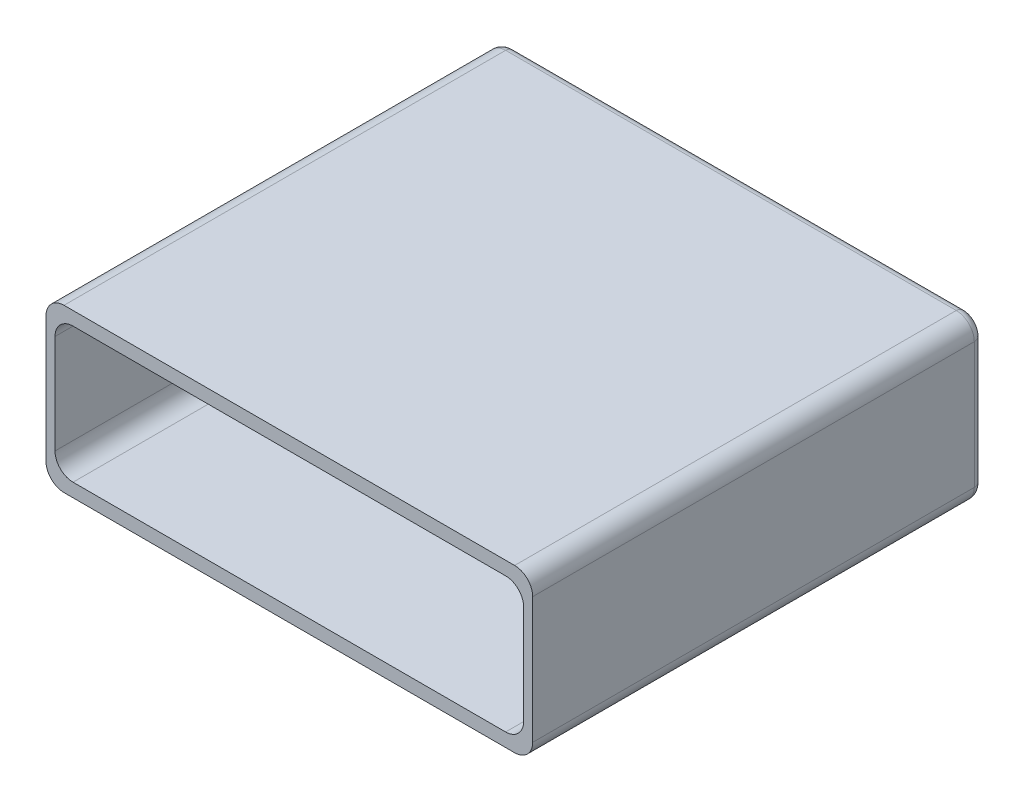
ISO-10303-21;
HEADER;
FILE_DESCRIPTION(('STEP AP214'),'2;1');
FILE_NAME('part.step','',(''),(''),'','','');
FILE_SCHEMA(('AUTOMOTIVE_DESIGN { 1 0 10303 214 1 1 1 1 }'));
ENDSEC;
DATA;
#1=APPLICATION_CONTEXT('core data for automotive mechanical design processes');
#2=APPLICATION_PROTOCOL_DEFINITION('international standard','automotive_design',2000,#1);
#3=PRODUCT_CONTEXT('',#1,'mechanical');
#4=PRODUCT('Part','Part','',(#3));
#5=PRODUCT_RELATED_PRODUCT_CATEGORY('part','',(#4));
#6=PRODUCT_DEFINITION_FORMATION('','',#4);
#7=PRODUCT_DEFINITION_CONTEXT('part definition',#1,'design');
#8=PRODUCT_DEFINITION('design','',#6,#7);
#9=PRODUCT_DEFINITION_SHAPE('','',#8);
#10=(LENGTH_UNIT() NAMED_UNIT(*) SI_UNIT(.MILLI.,.METRE.));
#11=(NAMED_UNIT(*) PLANE_ANGLE_UNIT() SI_UNIT($,.RADIAN.));
#12=(NAMED_UNIT(*) SI_UNIT($,.STERADIAN.) SOLID_ANGLE_UNIT());
#13=UNCERTAINTY_MEASURE_WITH_UNIT(LENGTH_MEASURE(1.E-05),#10,'distance_accuracy_value','');
#14=(GEOMETRIC_REPRESENTATION_CONTEXT(3) GLOBAL_UNCERTAINTY_ASSIGNED_CONTEXT((#13)) GLOBAL_UNIT_ASSIGNED_CONTEXT((#10,
#11,#12)) REPRESENTATION_CONTEXT('',''));
#15=CARTESIAN_POINT('',(0.,0.,0.));
#16=DIRECTION('',(0.,0.,1.));
#17=DIRECTION('',(1.,0.,0.));
#18=AXIS2_PLACEMENT_3D('',#15,#16,#17);
#19=CARTESIAN_POINT('',(-25.,-7.,50.));
#20=DIRECTION('',(0.,0.,-1.));
#21=DIRECTION('',(-1.,0.,0.));
#22=AXIS2_PLACEMENT_3D('',#19,#20,#21);
#23=CYLINDRICAL_SURFACE('',#22,2.);
#24=DIRECTION('',(0.,0.,-1.));
#25=VECTOR('',#24,1.);
#26=CARTESIAN_POINT('',(-27.,-6.99999999999999,50.));
#27=LINE('',#26,#25);
#28=CARTESIAN_POINT('',(-27.,-6.99999999999999,50.));
#29=VERTEX_POINT('',#28);
#30=CARTESIAN_POINT('',(-27.,-6.99999999999999,1.));
#31=VERTEX_POINT('',#30);
#32=EDGE_CURVE('E263',#29,#31,#27,.T.);
#33=ORIENTED_EDGE('',*,*,#32,.T.);
#34=CARTESIAN_POINT('',(-25.,-7.,1.));
#35=DIRECTION('',(0.,0.,1.));
#36=DIRECTION('',(1.,0.,0.));
#37=AXIS2_PLACEMENT_3D('',#34,#35,#36);
#38=CIRCLE('',#37,2.);
#39=CARTESIAN_POINT('',(-25.,-9.,1.));
#40=VERTEX_POINT('',#39);
#41=EDGE_CURVE('E284',#31,#40,#38,.T.);
#42=ORIENTED_EDGE('',*,*,#41,.T.);
#43=DIRECTION('',(0.,0.,-1.));
#44=VECTOR('',#43,1.);
#45=CARTESIAN_POINT('',(-25.,-9.,50.));
#46=LINE('',#45,#44);
#47=CARTESIAN_POINT('',(-25.,-9.,50.));
#48=VERTEX_POINT('',#47);
#49=EDGE_CURVE('E282',#48,#40,#46,.T.);
#50=ORIENTED_EDGE('',*,*,#49,.F.);
#51=CARTESIAN_POINT('',(-25.,-7.,50.));
#52=DIRECTION('',(0.,0.,1.));
#53=DIRECTION('',(1.,0.,0.));
#54=AXIS2_PLACEMENT_3D('',#51,#52,#53);
#55=CIRCLE('',#54,2.);
#56=EDGE_CURVE('E235',#29,#48,#55,.T.);
#57=ORIENTED_EDGE('',*,*,#56,.F.);
#58=EDGE_LOOP('',(#33,#42,#50,#57));
#59=FACE_BOUND('',#58,.T.);
#60=ADVANCED_FACE('F33',(#59),#23,.T.);
#61=CARTESIAN_POINT('',(25.,-9.,50.));
#62=DIRECTION('',(0.,1.,0.));
#63=DIRECTION('',(0.,0.,1.));
#64=AXIS2_PLACEMENT_3D('',#61,#62,#63);
#65=PLANE('',#64);
#66=ORIENTED_EDGE('',*,*,#49,.T.);
#67=DIRECTION('',(1.,0.,0.));
#68=VECTOR('',#67,1.);
#69=CARTESIAN_POINT('',(25.,-9.,1.));
#70=LINE('',#69,#68);
#71=CARTESIAN_POINT('',(25.,-9.,1.));
#72=VERTEX_POINT('',#71);
#73=EDGE_CURVE('E11',#40,#72,#70,.T.);
#74=ORIENTED_EDGE('',*,*,#73,.T.);
#75=DIRECTION('',(0.,0.,-1.));
#76=VECTOR('',#75,1.);
#77=CARTESIAN_POINT('',(25.,-9.,50.));
#78=LINE('',#77,#76);
#79=CARTESIAN_POINT('',(25.,-9.,50.));
#80=VERTEX_POINT('',#79);
#81=EDGE_CURVE('E280',#80,#72,#78,.T.);
#82=ORIENTED_EDGE('',*,*,#81,.F.);
#83=DIRECTION('',(1.,0.,0.));
#84=VECTOR('',#83,1.);
#85=CARTESIAN_POINT('',(25.,-9.,50.));
#86=LINE('',#85,#84);
#87=EDGE_CURVE('E249',#48,#80,#86,.T.);
#88=ORIENTED_EDGE('',*,*,#87,.F.);
#89=EDGE_LOOP('',(#66,#74,#82,#88));
#90=FACE_BOUND('',#89,.T.);
#91=ADVANCED_FACE('F406',(#90),#65,.F.);
#92=CARTESIAN_POINT('',(25.,-7.,50.));
#93=DIRECTION('',(0.,0.,-1.));
#94=DIRECTION('',(-1.,0.,0.));
#95=AXIS2_PLACEMENT_3D('',#92,#93,#94);
#96=CYLINDRICAL_SURFACE('',#95,2.);
#97=ORIENTED_EDGE('',*,*,#81,.T.);
#98=CARTESIAN_POINT('',(25.,-7.,1.));
#99=DIRECTION('',(0.,0.,1.));
#100=DIRECTION('',(1.,0.,0.));
#101=AXIS2_PLACEMENT_3D('',#98,#99,#100);
#102=CIRCLE('',#101,2.);
#103=CARTESIAN_POINT('',(27.,-6.99999999999999,1.));
#104=VERTEX_POINT('',#103);
#105=EDGE_CURVE('E42',#72,#104,#102,.T.);
#106=ORIENTED_EDGE('',*,*,#105,.T.);
#107=DIRECTION('',(0.,0.,-1.));
#108=VECTOR('',#107,1.);
#109=CARTESIAN_POINT('',(27.,-6.99999999999999,50.));
#110=LINE('',#109,#108);
#111=CARTESIAN_POINT('',(27.,-6.99999999999999,50.));
#112=VERTEX_POINT('',#111);
#113=EDGE_CURVE('E278',#112,#104,#110,.T.);
#114=ORIENTED_EDGE('',*,*,#113,.F.);
#115=CARTESIAN_POINT('',(25.,-7.,50.));
#116=DIRECTION('',(0.,0.,1.));
#117=DIRECTION('',(-1.,0.,0.));
#118=AXIS2_PLACEMENT_3D('',#115,#116,#117);
#119=CIRCLE('',#118,2.);
#120=EDGE_CURVE('E251',#80,#112,#119,.T.);
#121=ORIENTED_EDGE('',*,*,#120,.F.);
#122=EDGE_LOOP('',(#97,#106,#114,#121));
#123=FACE_BOUND('',#122,.T.);
#124=ADVANCED_FACE('F411',(#123),#96,.T.);
#125=CARTESIAN_POINT('',(27.,6.99999999999999,50.));
#126=DIRECTION('',(-1.,0.,0.));
#127=DIRECTION('',(0.,0.,1.));
#128=AXIS2_PLACEMENT_3D('',#125,#126,#127);
#129=PLANE('',#128);
#130=ORIENTED_EDGE('',*,*,#113,.T.);
#131=DIRECTION('',(0.,1.,0.));
#132=VECTOR('',#131,1.);
#133=CARTESIAN_POINT('',(27.,6.99999999999999,1.));
#134=LINE('',#133,#132);
#135=CARTESIAN_POINT('',(27.,6.99999999999999,1.));
#136=VERTEX_POINT('',#135);
#137=EDGE_CURVE('E312',#104,#136,#134,.T.);
#138=ORIENTED_EDGE('',*,*,#137,.T.);
#139=DIRECTION('',(0.,0.,-1.));
#140=VECTOR('',#139,1.);
#141=CARTESIAN_POINT('',(27.,6.99999999999999,50.));
#142=LINE('',#141,#140);
#143=CARTESIAN_POINT('',(27.,6.99999999999999,50.));
#144=VERTEX_POINT('',#143);
#145=EDGE_CURVE('E275',#144,#136,#142,.T.);
#146=ORIENTED_EDGE('',*,*,#145,.F.);
#147=DIRECTION('',(0.,1.,0.));
#148=VECTOR('',#147,1.);
#149=CARTESIAN_POINT('',(27.,6.99999999999999,50.));
#150=LINE('',#149,#148);
#151=EDGE_CURVE('E253',#112,#144,#150,.T.);
#152=ORIENTED_EDGE('',*,*,#151,.F.);
#153=EDGE_LOOP('',(#130,#138,#146,#152));
#154=FACE_BOUND('',#153,.T.);
#155=ADVANCED_FACE('F384',(#154),#129,.F.);
#156=CARTESIAN_POINT('',(25.,7.,50.));
#157=DIRECTION('',(0.,0.,-1.));
#158=DIRECTION('',(-1.,0.,0.));
#159=AXIS2_PLACEMENT_3D('',#156,#157,#158);
#160=CYLINDRICAL_SURFACE('',#159,2.);
#161=ORIENTED_EDGE('',*,*,#145,.T.);
#162=CARTESIAN_POINT('',(25.,7.,1.));
#163=DIRECTION('',(0.,0.,1.));
#164=DIRECTION('',(1.,0.,0.));
#165=AXIS2_PLACEMENT_3D('',#162,#163,#164);
#166=CIRCLE('',#165,2.);
#167=CARTESIAN_POINT('',(25.,9.,1.));
#168=VERTEX_POINT('',#167);
#169=EDGE_CURVE('E310',#136,#168,#166,.T.);
#170=ORIENTED_EDGE('',*,*,#169,.T.);
#171=DIRECTION('',(0.,0.,-1.));
#172=VECTOR('',#171,1.);
#173=CARTESIAN_POINT('',(25.,9.,50.));
#174=LINE('',#173,#172);
#175=CARTESIAN_POINT('',(25.,9.,50.));
#176=VERTEX_POINT('',#175);
#177=EDGE_CURVE('E272',#176,#168,#174,.T.);
#178=ORIENTED_EDGE('',*,*,#177,.F.);
#179=CARTESIAN_POINT('',(25.,7.,50.));
#180=DIRECTION('',(0.,0.,1.));
#181=DIRECTION('',(-1.,0.,0.));
#182=AXIS2_PLACEMENT_3D('',#179,#180,#181);
#183=CIRCLE('',#182,2.);
#184=EDGE_CURVE('E255',#144,#176,#183,.T.);
#185=ORIENTED_EDGE('',*,*,#184,.F.);
#186=EDGE_LOOP('',(#161,#170,#178,#185));
#187=FACE_BOUND('',#186,.T.);
#188=ADVANCED_FACE('F380',(#187),#160,.T.);
#189=CARTESIAN_POINT('',(25.,9.,50.));
#190=DIRECTION('',(0.,-1.,0.));
#191=DIRECTION('',(0.,0.,-1.));
#192=AXIS2_PLACEMENT_3D('',#189,#190,#191);
#193=PLANE('',#192);
#194=ORIENTED_EDGE('',*,*,#177,.T.);
#195=DIRECTION('',(-1.,0.,0.));
#196=VECTOR('',#195,1.);
#197=CARTESIAN_POINT('',(25.,9.,1.));
#198=LINE('',#197,#196);
#199=CARTESIAN_POINT('',(-25.,9.,1.));
#200=VERTEX_POINT('',#199);
#201=EDGE_CURVE('E308',#168,#200,#198,.T.);
#202=ORIENTED_EDGE('',*,*,#201,.T.);
#203=DIRECTION('',(0.,0.,-1.));
#204=VECTOR('',#203,1.);
#205=CARTESIAN_POINT('',(-25.,9.,50.));
#206=LINE('',#205,#204);
#207=CARTESIAN_POINT('',(-25.,9.,50.));
#208=VERTEX_POINT('',#207);
#209=EDGE_CURVE('E269',#208,#200,#206,.T.);
#210=ORIENTED_EDGE('',*,*,#209,.F.);
#211=DIRECTION('',(-1.,0.,0.));
#212=VECTOR('',#211,1.);
#213=CARTESIAN_POINT('',(25.,9.,50.));
#214=LINE('',#213,#212);
#215=EDGE_CURVE('E257',#176,#208,#214,.T.);
#216=ORIENTED_EDGE('',*,*,#215,.F.);
#217=EDGE_LOOP('',(#194,#202,#210,#216));
#218=FACE_BOUND('',#217,.T.);
#219=ADVANCED_FACE('F376',(#218),#193,.F.);
#220=CARTESIAN_POINT('',(-25.,7.,50.));
#221=DIRECTION('',(0.,0.,-1.));
#222=DIRECTION('',(-1.,0.,0.));
#223=AXIS2_PLACEMENT_3D('',#220,#221,#222);
#224=CYLINDRICAL_SURFACE('',#223,2.);
#225=ORIENTED_EDGE('',*,*,#209,.T.);
#226=CARTESIAN_POINT('',(-25.,7.,1.));
#227=DIRECTION('',(0.,0.,1.));
#228=DIRECTION('',(1.,0.,0.));
#229=AXIS2_PLACEMENT_3D('',#226,#227,#228);
#230=CIRCLE('',#229,2.);
#231=CARTESIAN_POINT('',(-27.,6.99999999999999,1.));
#232=VERTEX_POINT('',#231);
#233=EDGE_CURVE('E306',#200,#232,#230,.T.);
#234=ORIENTED_EDGE('',*,*,#233,.T.);
#235=DIRECTION('',(0.,0.,-1.));
#236=VECTOR('',#235,1.);
#237=CARTESIAN_POINT('',(-27.,6.99999999999999,50.));
#238=LINE('',#237,#236);
#239=CARTESIAN_POINT('',(-27.,6.99999999999999,50.));
#240=VERTEX_POINT('',#239);
#241=EDGE_CURVE('E266',#240,#232,#238,.T.);
#242=ORIENTED_EDGE('',*,*,#241,.F.);
#243=CARTESIAN_POINT('',(-25.,7.,50.));
#244=DIRECTION('',(0.,0.,1.));
#245=DIRECTION('',(1.,0.,0.));
#246=AXIS2_PLACEMENT_3D('',#243,#244,#245);
#247=CIRCLE('',#246,2.);
#248=EDGE_CURVE('E259',#208,#240,#247,.T.);
#249=ORIENTED_EDGE('',*,*,#248,.F.);
#250=EDGE_LOOP('',(#225,#234,#242,#249));
#251=FACE_BOUND('',#250,.T.);
#252=ADVANCED_FACE('F374',(#251),#224,.T.);
#253=CARTESIAN_POINT('',(-27.,6.99999999999999,50.));
#254=DIRECTION('',(1.,0.,0.));
#255=DIRECTION('',(0.,0.,-1.));
#256=AXIS2_PLACEMENT_3D('',#253,#254,#255);
#257=PLANE('',#256);
#258=ORIENTED_EDGE('',*,*,#241,.T.);
#259=DIRECTION('',(0.,-1.,0.));
#260=VECTOR('',#259,1.);
#261=CARTESIAN_POINT('',(-27.,6.99999999999999,1.));
#262=LINE('',#261,#260);
#263=EDGE_CURVE('E304',#232,#31,#262,.T.);
#264=ORIENTED_EDGE('',*,*,#263,.T.);
#265=ORIENTED_EDGE('',*,*,#32,.F.);
#266=DIRECTION('',(0.,-1.,0.));
#267=VECTOR('',#266,1.);
#268=CARTESIAN_POINT('',(-27.,6.99999999999999,50.));
#269=LINE('',#268,#267);
#270=EDGE_CURVE('E261',#240,#29,#269,.T.);
#271=ORIENTED_EDGE('',*,*,#270,.F.);
#272=EDGE_LOOP('',(#258,#264,#265,#271));
#273=FACE_BOUND('',#272,.T.);
#274=ADVANCED_FACE('F362',(#273),#257,.F.);
#275=CARTESIAN_POINT('',(-25.,-7.,50.));
#276=DIRECTION('',(0.,0.,1.));
#277=DIRECTION('',(1.,0.,0.));
#278=AXIS2_PLACEMENT_3D('',#275,#276,#277);
#279=PLANE('',#278);
#280=CARTESIAN_POINT('',(24.,-5.5,50.));
#281=DIRECTION('',(0.,0.,1.));
#282=DIRECTION('',(1.,0.,0.));
#283=AXIS2_PLACEMENT_3D('',#280,#281,#282);
#284=CIRCLE('',#283,2.);
#285=CARTESIAN_POINT('',(24.,-7.5,50.));
#286=VERTEX_POINT('',#285);
#287=CARTESIAN_POINT('',(26.,-5.5,50.));
#288=VERTEX_POINT('',#287);
#289=EDGE_CURVE('E179',#286,#288,#284,.T.);
#290=ORIENTED_EDGE('',*,*,#289,.F.);
#291=DIRECTION('',(1.,0.,0.));
#292=VECTOR('',#291,1.);
#293=CARTESIAN_POINT('',(24.,-7.5,50.));
#294=LINE('',#293,#292);
#295=CARTESIAN_POINT('',(-24.,-7.5,50.));
#296=VERTEX_POINT('',#295);
#297=EDGE_CURVE('E197',#296,#286,#294,.T.);
#298=ORIENTED_EDGE('',*,*,#297,.F.);
#299=CARTESIAN_POINT('',(-24.,-5.5,50.));
#300=DIRECTION('',(0.,0.,1.));
#301=DIRECTION('',(1.,0.,0.));
#302=AXIS2_PLACEMENT_3D('',#299,#300,#301);
#303=CIRCLE('',#302,2.);
#304=CARTESIAN_POINT('',(-26.,-5.5,50.));
#305=VERTEX_POINT('',#304);
#306=EDGE_CURVE('E200',#305,#296,#303,.T.);
#307=ORIENTED_EDGE('',*,*,#306,.F.);
#308=DIRECTION('',(0.,-1.,0.));
#309=VECTOR('',#308,1.);
#310=CARTESIAN_POINT('',(-26.,-5.5,50.));
#311=LINE('',#310,#309);
#312=CARTESIAN_POINT('',(-26.,5.5,50.));
#313=VERTEX_POINT('',#312);
#314=EDGE_CURVE('E228',#313,#305,#311,.T.);
#315=ORIENTED_EDGE('',*,*,#314,.F.);
#316=CARTESIAN_POINT('',(-24.,5.5,50.));
#317=DIRECTION('',(0.,0.,1.));
#318=DIRECTION('',(1.,0.,0.));
#319=AXIS2_PLACEMENT_3D('',#316,#317,#318);
#320=CIRCLE('',#319,2.);
#321=CARTESIAN_POINT('',(-24.,7.5,50.));
#322=VERTEX_POINT('',#321);
#323=EDGE_CURVE('E225',#322,#313,#320,.T.);
#324=ORIENTED_EDGE('',*,*,#323,.F.);
#325=DIRECTION('',(-1.,0.,0.));
#326=VECTOR('',#325,1.);
#327=CARTESIAN_POINT('',(24.,7.5,50.));
#328=LINE('',#327,#326);
#329=CARTESIAN_POINT('',(24.,7.5,50.));
#330=VERTEX_POINT('',#329);
#331=EDGE_CURVE('E222',#330,#322,#328,.T.);
#332=ORIENTED_EDGE('',*,*,#331,.F.);
#333=CARTESIAN_POINT('',(24.,5.5,50.));
#334=DIRECTION('',(0.,0.,1.));
#335=DIRECTION('',(1.,0.,0.));
#336=AXIS2_PLACEMENT_3D('',#333,#334,#335);
#337=CIRCLE('',#336,2.);
#338=CARTESIAN_POINT('',(26.,5.5,50.));
#339=VERTEX_POINT('',#338);
#340=EDGE_CURVE('E219',#339,#330,#337,.T.);
#341=ORIENTED_EDGE('',*,*,#340,.F.);
#342=DIRECTION('',(0.,1.,0.));
#343=VECTOR('',#342,1.);
#344=CARTESIAN_POINT('',(26.,-5.5,50.));
#345=LINE('',#344,#343);
#346=EDGE_CURVE('E217',#288,#339,#345,.T.);
#347=ORIENTED_EDGE('',*,*,#346,.F.);
#348=EDGE_LOOP('',(#290,#298,#307,#315,#324,#332,#341,#347));
#349=FACE_BOUND('',#348,.T.);
#350=ORIENTED_EDGE('',*,*,#56,.T.);
#351=ORIENTED_EDGE('',*,*,#87,.T.);
#352=ORIENTED_EDGE('',*,*,#120,.T.);
#353=ORIENTED_EDGE('',*,*,#151,.T.);
#354=ORIENTED_EDGE('',*,*,#184,.T.);
#355=ORIENTED_EDGE('',*,*,#215,.T.);
#356=ORIENTED_EDGE('',*,*,#248,.T.);
#357=ORIENTED_EDGE('',*,*,#270,.T.);
#358=EDGE_LOOP('',(#350,#351,#352,#353,#354,#355,#356,#357));
#359=FACE_BOUND('',#358,.T.);
#360=ADVANCED_FACE('F369',(#349,#359),#279,.T.);
#361=CARTESIAN_POINT('',(-25.,-7.,0.));
#362=DIRECTION('',(0.,0.,1.));
#363=DIRECTION('',(1.,0.,0.));
#364=AXIS2_PLACEMENT_3D('',#361,#362,#363);
#365=PLANE('',#364);
#366=DIRECTION('',(1.,0.,0.));
#367=VECTOR('',#366,1.);
#368=CARTESIAN_POINT('',(-25.,-8.,0.));
#369=LINE('',#368,#367);
#370=CARTESIAN_POINT('',(25.,-8.,0.));
#371=VERTEX_POINT('',#370);
#372=CARTESIAN_POINT('',(-25.,-8.,0.));
#373=VERTEX_POINT('',#372);
#374=EDGE_CURVE('E287',#371,#373,#369,.F.);
#375=ORIENTED_EDGE('',*,*,#374,.T.);
#376=CARTESIAN_POINT('',(-25.,-7.,0.));
#377=DIRECTION('',(0.,0.,1.));
#378=DIRECTION('',(1.,0.,0.));
#379=AXIS2_PLACEMENT_3D('',#376,#377,#378);
#380=CIRCLE('',#379,1.);
#381=CARTESIAN_POINT('',(-26.,-6.99999999999999,0.));
#382=VERTEX_POINT('',#381);
#383=EDGE_CURVE('E301',#373,#382,#380,.F.);
#384=ORIENTED_EDGE('',*,*,#383,.T.);
#385=DIRECTION('',(0.,-1.,0.));
#386=VECTOR('',#385,1.);
#387=CARTESIAN_POINT('',(-26.,-7.,0.));
#388=LINE('',#387,#386);
#389=CARTESIAN_POINT('',(-26.,6.99999999999999,0.));
#390=VERTEX_POINT('',#389);
#391=EDGE_CURVE('E299',#382,#390,#388,.F.);
#392=ORIENTED_EDGE('',*,*,#391,.T.);
#393=CARTESIAN_POINT('',(-25.,7.,0.));
#394=DIRECTION('',(0.,0.,1.));
#395=DIRECTION('',(1.,0.,0.));
#396=AXIS2_PLACEMENT_3D('',#393,#394,#395);
#397=CIRCLE('',#396,1.);
#398=CARTESIAN_POINT('',(-25.,8.,0.));
#399=VERTEX_POINT('',#398);
#400=EDGE_CURVE('E297',#390,#399,#397,.F.);
#401=ORIENTED_EDGE('',*,*,#400,.T.);
#402=DIRECTION('',(-1.,0.,0.));
#403=VECTOR('',#402,1.);
#404=CARTESIAN_POINT('',(-25.,8.,0.));
#405=LINE('',#404,#403);
#406=CARTESIAN_POINT('',(25.,8.,0.));
#407=VERTEX_POINT('',#406);
#408=EDGE_CURVE('E295',#399,#407,#405,.F.);
#409=ORIENTED_EDGE('',*,*,#408,.T.);
#410=CARTESIAN_POINT('',(25.,7.,0.));
#411=DIRECTION('',(0.,0.,1.));
#412=DIRECTION('',(1.,0.,0.));
#413=AXIS2_PLACEMENT_3D('',#410,#411,#412);
#414=CIRCLE('',#413,1.);
#415=CARTESIAN_POINT('',(26.,6.99999999999999,0.));
#416=VERTEX_POINT('',#415);
#417=EDGE_CURVE('E293',#407,#416,#414,.F.);
#418=ORIENTED_EDGE('',*,*,#417,.T.);
#419=DIRECTION('',(0.,1.,0.));
#420=VECTOR('',#419,1.);
#421=CARTESIAN_POINT('',(26.,-7.,0.));
#422=LINE('',#421,#420);
#423=CARTESIAN_POINT('',(26.,-6.99999999999999,0.));
#424=VERTEX_POINT('',#423);
#425=EDGE_CURVE('E291',#416,#424,#422,.F.);
#426=ORIENTED_EDGE('',*,*,#425,.T.);
#427=CARTESIAN_POINT('',(25.,-7.,0.));
#428=DIRECTION('',(0.,0.,1.));
#429=DIRECTION('',(1.,0.,0.));
#430=AXIS2_PLACEMENT_3D('',#427,#428,#429);
#431=CIRCLE('',#430,1.);
#432=EDGE_CURVE('E289',#424,#371,#431,.F.);
#433=ORIENTED_EDGE('',*,*,#432,.T.);
#434=EDGE_LOOP('',(#375,#384,#392,#401,#409,#418,#426,#433));
#435=FACE_BOUND('',#434,.T.);
#436=ADVANCED_FACE('F347',(#435),#365,.F.);
#437=CARTESIAN_POINT('',(24.,-5.5,2.));
#438=DIRECTION('',(0.,0.,1.));
#439=DIRECTION('',(1.,0.,0.));
#440=AXIS2_PLACEMENT_3D('',#437,#438,#439);
#441=CYLINDRICAL_SURFACE('',#440,2.);
#442=ORIENTED_EDGE('',*,*,#289,.T.);
#443=DIRECTION('',(0.,0.,1.));
#444=VECTOR('',#443,1.);
#445=CARTESIAN_POINT('',(26.,-5.5,2.));
#446=LINE('',#445,#444);
#447=CARTESIAN_POINT('',(26.,-5.5,2.));
#448=VERTEX_POINT('',#447);
#449=EDGE_CURVE('E172',#448,#288,#446,.T.);
#450=ORIENTED_EDGE('',*,*,#449,.F.);
#451=CARTESIAN_POINT('',(24.,-5.5,2.));
#452=DIRECTION('',(0.,0.,1.));
#453=DIRECTION('',(1.,0.,0.));
#454=AXIS2_PLACEMENT_3D('',#451,#452,#453);
#455=CIRCLE('',#454,2.);
#456=CARTESIAN_POINT('',(24.,-7.5,2.));
#457=VERTEX_POINT('',#456);
#458=EDGE_CURVE('E176',#457,#448,#455,.T.);
#459=ORIENTED_EDGE('',*,*,#458,.F.);
#460=DIRECTION('',(0.,0.,1.));
#461=VECTOR('',#460,1.);
#462=CARTESIAN_POINT('',(24.,-7.5,2.));
#463=LINE('',#462,#461);
#464=EDGE_CURVE('E233',#457,#286,#463,.T.);
#465=ORIENTED_EDGE('',*,*,#464,.T.);
#466=EDGE_LOOP('',(#442,#450,#459,#465));
#467=FACE_BOUND('',#466,.T.);
#468=ADVANCED_FACE('F174',(#467),#441,.F.);
#469=CARTESIAN_POINT('',(24.,-7.5,2.));
#470=DIRECTION('',(0.,-1.,0.));
#471=DIRECTION('',(1.,0.,0.));
#472=AXIS2_PLACEMENT_3D('',#469,#470,#471);
#473=PLANE('',#472);
#474=ORIENTED_EDGE('',*,*,#297,.T.);
#475=ORIENTED_EDGE('',*,*,#464,.F.);
#476=DIRECTION('',(1.,0.,0.));
#477=VECTOR('',#476,1.);
#478=CARTESIAN_POINT('',(24.,-7.5,2.));
#479=LINE('',#478,#477);
#480=CARTESIAN_POINT('',(-24.,-7.5,2.));
#481=VERTEX_POINT('',#480);
#482=EDGE_CURVE('E184',#481,#457,#479,.T.);
#483=ORIENTED_EDGE('',*,*,#482,.F.);
#484=DIRECTION('',(0.,0.,1.));
#485=VECTOR('',#484,1.);
#486=CARTESIAN_POINT('',(-24.,-7.5,2.));
#487=LINE('',#486,#485);
#488=EDGE_CURVE('E236',#481,#296,#487,.T.);
#489=ORIENTED_EDGE('',*,*,#488,.T.);
#490=EDGE_LOOP('',(#474,#475,#483,#489));
#491=FACE_BOUND('',#490,.T.);
#492=ADVANCED_FACE('F433',(#491),#473,.F.);
#493=CARTESIAN_POINT('',(-24.,-5.5,2.));
#494=DIRECTION('',(0.,0.,1.));
#495=DIRECTION('',(1.,0.,0.));
#496=AXIS2_PLACEMENT_3D('',#493,#494,#495);
#497=CYLINDRICAL_SURFACE('',#496,2.);
#498=ORIENTED_EDGE('',*,*,#306,.T.);
#499=ORIENTED_EDGE('',*,*,#488,.F.);
#500=CARTESIAN_POINT('',(-24.,-5.5,2.));
#501=DIRECTION('',(0.,0.,1.));
#502=DIRECTION('',(1.,0.,0.));
#503=AXIS2_PLACEMENT_3D('',#500,#501,#502);
#504=CIRCLE('',#503,2.);
#505=CARTESIAN_POINT('',(-26.,-5.5,2.));
#506=VERTEX_POINT('',#505);
#507=EDGE_CURVE('E213',#506,#481,#504,.T.);
#508=ORIENTED_EDGE('',*,*,#507,.F.);
#509=DIRECTION('',(0.,0.,1.));
#510=VECTOR('',#509,1.);
#511=CARTESIAN_POINT('',(-26.,-5.5,2.));
#512=LINE('',#511,#510);
#513=EDGE_CURVE('E238',#506,#305,#512,.T.);
#514=ORIENTED_EDGE('',*,*,#513,.T.);
#515=EDGE_LOOP('',(#498,#499,#508,#514));
#516=FACE_BOUND('',#515,.T.);
#517=ADVANCED_FACE('F451',(#516),#497,.F.);
#518=CARTESIAN_POINT('',(-26.,-5.5,2.));
#519=DIRECTION('',(-1.,0.,0.));
#520=DIRECTION('',(0.,0.,1.));
#521=AXIS2_PLACEMENT_3D('',#518,#519,#520);
#522=PLANE('',#521);
#523=ORIENTED_EDGE('',*,*,#314,.T.);
#524=ORIENTED_EDGE('',*,*,#513,.F.);
#525=DIRECTION('',(0.,-1.,0.));
#526=VECTOR('',#525,1.);
#527=CARTESIAN_POINT('',(-26.,-5.5,2.));
#528=LINE('',#527,#526);
#529=CARTESIAN_POINT('',(-26.,5.5,2.));
#530=VERTEX_POINT('',#529);
#531=EDGE_CURVE('E210',#530,#506,#528,.T.);
#532=ORIENTED_EDGE('',*,*,#531,.F.);
#533=DIRECTION('',(0.,0.,1.));
#534=VECTOR('',#533,1.);
#535=CARTESIAN_POINT('',(-26.,5.5,2.));
#536=LINE('',#535,#534);
#537=EDGE_CURVE('E240',#530,#313,#536,.T.);
#538=ORIENTED_EDGE('',*,*,#537,.T.);
#539=EDGE_LOOP('',(#523,#524,#532,#538));
#540=FACE_BOUND('',#539,.T.);
#541=ADVANCED_FACE('F447',(#540),#522,.F.);
#542=CARTESIAN_POINT('',(-24.,5.5,2.));
#543=DIRECTION('',(0.,0.,1.));
#544=DIRECTION('',(1.,0.,0.));
#545=AXIS2_PLACEMENT_3D('',#542,#543,#544);
#546=CYLINDRICAL_SURFACE('',#545,2.);
#547=ORIENTED_EDGE('',*,*,#323,.T.);
#548=ORIENTED_EDGE('',*,*,#537,.F.);
#549=CARTESIAN_POINT('',(-24.,5.5,2.));
#550=DIRECTION('',(0.,0.,1.));
#551=DIRECTION('',(1.,0.,0.));
#552=AXIS2_PLACEMENT_3D('',#549,#550,#551);
#553=CIRCLE('',#552,2.);
#554=CARTESIAN_POINT('',(-24.,7.5,2.));
#555=VERTEX_POINT('',#554);
#556=EDGE_CURVE('E207',#555,#530,#553,.T.);
#557=ORIENTED_EDGE('',*,*,#556,.F.);
#558=DIRECTION('',(0.,0.,1.));
#559=VECTOR('',#558,1.);
#560=CARTESIAN_POINT('',(-24.,7.5,2.));
#561=LINE('',#560,#559);
#562=EDGE_CURVE('E242',#555,#322,#561,.T.);
#563=ORIENTED_EDGE('',*,*,#562,.T.);
#564=EDGE_LOOP('',(#547,#548,#557,#563));
#565=FACE_BOUND('',#564,.T.);
#566=ADVANCED_FACE('F443',(#565),#546,.F.);
#567=CARTESIAN_POINT('',(24.,7.5,2.));
#568=DIRECTION('',(0.,1.,0.));
#569=DIRECTION('',(-1.,0.,0.));
#570=AXIS2_PLACEMENT_3D('',#567,#568,#569);
#571=PLANE('',#570);
#572=ORIENTED_EDGE('',*,*,#331,.T.);
#573=ORIENTED_EDGE('',*,*,#562,.F.);
#574=DIRECTION('',(-1.,0.,0.));
#575=VECTOR('',#574,1.);
#576=CARTESIAN_POINT('',(24.,7.5,2.));
#577=LINE('',#576,#575);
#578=CARTESIAN_POINT('',(24.,7.5,2.));
#579=VERTEX_POINT('',#578);
#580=EDGE_CURVE('E204',#579,#555,#577,.T.);
#581=ORIENTED_EDGE('',*,*,#580,.F.);
#582=DIRECTION('',(0.,0.,1.));
#583=VECTOR('',#582,1.);
#584=CARTESIAN_POINT('',(24.,7.5,2.));
#585=LINE('',#584,#583);
#586=EDGE_CURVE('E244',#579,#330,#585,.T.);
#587=ORIENTED_EDGE('',*,*,#586,.T.);
#588=EDGE_LOOP('',(#572,#573,#581,#587));
#589=FACE_BOUND('',#588,.T.);
#590=ADVANCED_FACE('F439',(#589),#571,.F.);
#591=CARTESIAN_POINT('',(24.,5.5,2.));
#592=DIRECTION('',(0.,0.,1.));
#593=DIRECTION('',(1.,0.,0.));
#594=AXIS2_PLACEMENT_3D('',#591,#592,#593);
#595=CYLINDRICAL_SURFACE('',#594,2.);
#596=ORIENTED_EDGE('',*,*,#340,.T.);
#597=ORIENTED_EDGE('',*,*,#586,.F.);
#598=CARTESIAN_POINT('',(24.,5.5,2.));
#599=DIRECTION('',(0.,0.,1.));
#600=DIRECTION('',(1.,0.,0.));
#601=AXIS2_PLACEMENT_3D('',#598,#599,#600);
#602=CIRCLE('',#601,2.);
#603=CARTESIAN_POINT('',(26.,5.5,2.));
#604=VERTEX_POINT('',#603);
#605=EDGE_CURVE('E192',#604,#579,#602,.T.);
#606=ORIENTED_EDGE('',*,*,#605,.F.);
#607=DIRECTION('',(0.,0.,1.));
#608=VECTOR('',#607,1.);
#609=CARTESIAN_POINT('',(26.,5.5,2.));
#610=LINE('',#609,#608);
#611=EDGE_CURVE('E183',#604,#339,#610,.T.);
#612=ORIENTED_EDGE('',*,*,#611,.T.);
#613=EDGE_LOOP('',(#596,#597,#606,#612));
#614=FACE_BOUND('',#613,.T.);
#615=ADVANCED_FACE('F436',(#614),#595,.F.);
#616=CARTESIAN_POINT('',(26.,-5.5,2.));
#617=DIRECTION('',(1.,0.,0.));
#618=DIRECTION('',(0.,1.,0.));
#619=AXIS2_PLACEMENT_3D('',#616,#617,#618);
#620=PLANE('',#619);
#621=ORIENTED_EDGE('',*,*,#346,.T.);
#622=ORIENTED_EDGE('',*,*,#611,.F.);
#623=DIRECTION('',(0.,1.,0.));
#624=VECTOR('',#623,1.);
#625=CARTESIAN_POINT('',(26.,-5.5,2.));
#626=LINE('',#625,#624);
#627=EDGE_CURVE('E187',#448,#604,#626,.T.);
#628=ORIENTED_EDGE('',*,*,#627,.F.);
#629=ORIENTED_EDGE('',*,*,#449,.T.);
#630=EDGE_LOOP('',(#621,#622,#628,#629));
#631=FACE_BOUND('',#630,.T.);
#632=ADVANCED_FACE('F188',(#631),#620,.F.);
#633=CARTESIAN_POINT('',(24.,-5.5,2.));
#634=DIRECTION('',(0.,0.,1.));
#635=DIRECTION('',(1.,0.,0.));
#636=AXIS2_PLACEMENT_3D('',#633,#634,#635);
#637=PLANE('',#636);
#638=ORIENTED_EDGE('',*,*,#458,.T.);
#639=ORIENTED_EDGE('',*,*,#627,.T.);
#640=ORIENTED_EDGE('',*,*,#605,.T.);
#641=ORIENTED_EDGE('',*,*,#580,.T.);
#642=ORIENTED_EDGE('',*,*,#556,.T.);
#643=ORIENTED_EDGE('',*,*,#531,.T.);
#644=ORIENTED_EDGE('',*,*,#507,.T.);
#645=ORIENTED_EDGE('',*,*,#482,.T.);
#646=EDGE_LOOP('',(#638,#639,#640,#641,#642,#643,#644,#645));
#647=FACE_BOUND('',#646,.T.);
#648=ADVANCED_FACE('F194',(#647),#637,.T.);
#649=CARTESIAN_POINT('',(25.,7.,1.));
#650=DIRECTION('',(0.,0.,1.));
#651=DIRECTION('',(1.,0.,0.));
#652=AXIS2_PLACEMENT_3D('',#649,#650,#651);
#653=TOROIDAL_SURFACE('',#652,1.,1.);
#654=CARTESIAN_POINT('',(26.,6.99999999999999,1.));
#655=DIRECTION('',(0.,-1.,0.));
#656=DIRECTION('',(1.,0.,0.));
#657=AXIS2_PLACEMENT_3D('',#654,#655,#656);
#658=CIRCLE('',#657,1.);
#659=EDGE_CURVE('E330',#416,#136,#658,.T.);
#660=ORIENTED_EDGE('',*,*,#659,.F.);
#661=ORIENTED_EDGE('',*,*,#417,.F.);
#662=CARTESIAN_POINT('',(25.,8.,1.));
#663=DIRECTION('',(-1.,0.,0.));
#664=DIRECTION('',(0.,-1.,0.));
#665=AXIS2_PLACEMENT_3D('',#662,#663,#664);
#666=CIRCLE('',#665,1.);
#667=EDGE_CURVE('E37',#168,#407,#666,.T.);
#668=ORIENTED_EDGE('',*,*,#667,.F.);
#669=ORIENTED_EDGE('',*,*,#169,.F.);
#670=EDGE_LOOP('',(#660,#661,#668,#669));
#671=FACE_BOUND('',#670,.T.);
#672=ADVANCED_FACE('F35',(#671),#653,.T.);
#673=CARTESIAN_POINT('',(25.,8.,1.));
#674=DIRECTION('',(-1.,0.,0.));
#675=DIRECTION('',(0.,0.,1.));
#676=AXIS2_PLACEMENT_3D('',#673,#674,#675);
#677=CYLINDRICAL_SURFACE('',#676,1.);
#678=ORIENTED_EDGE('',*,*,#667,.T.);
#679=ORIENTED_EDGE('',*,*,#408,.F.);
#680=CARTESIAN_POINT('',(-25.,8.,1.));
#681=DIRECTION('',(-1.,0.,0.));
#682=DIRECTION('',(0.,0.,1.));
#683=AXIS2_PLACEMENT_3D('',#680,#681,#682);
#684=CIRCLE('',#683,1.);
#685=EDGE_CURVE('E328',#200,#399,#684,.T.);
#686=ORIENTED_EDGE('',*,*,#685,.F.);
#687=ORIENTED_EDGE('',*,*,#201,.F.);
#688=EDGE_LOOP('',(#678,#679,#686,#687));
#689=FACE_BOUND('',#688,.T.);
#690=ADVANCED_FACE('F341',(#689),#677,.T.);
#691=CARTESIAN_POINT('',(26.,6.99999999999999,1.));
#692=DIRECTION('',(0.,1.,0.));
#693=DIRECTION('',(0.,0.,1.));
#694=AXIS2_PLACEMENT_3D('',#691,#692,#693);
#695=CYLINDRICAL_SURFACE('',#694,1.);
#696=ORIENTED_EDGE('',*,*,#659,.T.);
#697=ORIENTED_EDGE('',*,*,#137,.F.);
#698=CARTESIAN_POINT('',(26.,-6.99999999999999,1.));
#699=DIRECTION('',(0.,-1.,0.));
#700=DIRECTION('',(0.,0.,-1.));
#701=AXIS2_PLACEMENT_3D('',#698,#699,#700);
#702=CIRCLE('',#701,1.);
#703=EDGE_CURVE('E325',#424,#104,#702,.T.);
#704=ORIENTED_EDGE('',*,*,#703,.F.);
#705=ORIENTED_EDGE('',*,*,#425,.F.);
#706=EDGE_LOOP('',(#696,#697,#704,#705));
#707=FACE_BOUND('',#706,.T.);
#708=ADVANCED_FACE('F385',(#707),#695,.T.);
#709=CARTESIAN_POINT('',(-25.,7.,1.));
#710=DIRECTION('',(0.,0.,1.));
#711=DIRECTION('',(1.,0.,0.));
#712=AXIS2_PLACEMENT_3D('',#709,#710,#711);
#713=TOROIDAL_SURFACE('',#712,1.,1.);
#714=ORIENTED_EDGE('',*,*,#685,.T.);
#715=ORIENTED_EDGE('',*,*,#400,.F.);
#716=CARTESIAN_POINT('',(-26.,6.99999999999999,1.));
#717=DIRECTION('',(0.,-1.,0.));
#718=DIRECTION('',(0.,0.,-1.));
#719=AXIS2_PLACEMENT_3D('',#716,#717,#718);
#720=CIRCLE('',#719,1.);
#721=EDGE_CURVE('E322',#232,#390,#720,.T.);
#722=ORIENTED_EDGE('',*,*,#721,.F.);
#723=ORIENTED_EDGE('',*,*,#233,.F.);
#724=EDGE_LOOP('',(#714,#715,#722,#723));
#725=FACE_BOUND('',#724,.T.);
#726=ADVANCED_FACE('F353',(#725),#713,.T.);
#727=CARTESIAN_POINT('',(25.,-7.,1.));
#728=DIRECTION('',(0.,0.,1.));
#729=DIRECTION('',(1.,0.,0.));
#730=AXIS2_PLACEMENT_3D('',#727,#728,#729);
#731=TOROIDAL_SURFACE('',#730,1.,1.);
#732=ORIENTED_EDGE('',*,*,#703,.T.);
#733=ORIENTED_EDGE('',*,*,#105,.F.);
#734=CARTESIAN_POINT('',(25.,-8.,1.));
#735=DIRECTION('',(-1.,0.,0.));
#736=DIRECTION('',(0.,-1.,0.));
#737=AXIS2_PLACEMENT_3D('',#734,#735,#736);
#738=CIRCLE('',#737,1.);
#739=EDGE_CURVE('E319',#371,#72,#738,.T.);
#740=ORIENTED_EDGE('',*,*,#739,.F.);
#741=ORIENTED_EDGE('',*,*,#432,.F.);
#742=EDGE_LOOP('',(#732,#733,#740,#741));
#743=FACE_BOUND('',#742,.T.);
#744=ADVANCED_FACE('F388',(#743),#731,.T.);
#745=CARTESIAN_POINT('',(-26.,6.99999999999999,1.));
#746=DIRECTION('',(0.,-1.,0.));
#747=DIRECTION('',(0.,0.,-1.));
#748=AXIS2_PLACEMENT_3D('',#745,#746,#747);
#749=CYLINDRICAL_SURFACE('',#748,1.);
#750=ORIENTED_EDGE('',*,*,#721,.T.);
#751=ORIENTED_EDGE('',*,*,#391,.F.);
#752=CARTESIAN_POINT('',(-26.,-6.99999999999999,1.));
#753=DIRECTION('',(0.,-1.,0.));
#754=DIRECTION('',(0.,0.,-1.));
#755=AXIS2_PLACEMENT_3D('',#752,#753,#754);
#756=CIRCLE('',#755,1.);
#757=EDGE_CURVE('E317',#31,#382,#756,.T.);
#758=ORIENTED_EDGE('',*,*,#757,.F.);
#759=ORIENTED_EDGE('',*,*,#263,.F.);
#760=EDGE_LOOP('',(#750,#751,#758,#759));
#761=FACE_BOUND('',#760,.T.);
#762=ADVANCED_FACE('F357',(#761),#749,.T.);
#763=CARTESIAN_POINT('',(25.,-8.,1.));
#764=DIRECTION('',(1.,0.,0.));
#765=DIRECTION('',(0.,0.,-1.));
#766=AXIS2_PLACEMENT_3D('',#763,#764,#765);
#767=CYLINDRICAL_SURFACE('',#766,1.);
#768=ORIENTED_EDGE('',*,*,#739,.T.);
#769=ORIENTED_EDGE('',*,*,#73,.F.);
#770=CARTESIAN_POINT('',(-25.,-8.,1.));
#771=DIRECTION('',(-1.,0.,0.));
#772=DIRECTION('',(0.,-1.,0.));
#773=AXIS2_PLACEMENT_3D('',#770,#771,#772);
#774=CIRCLE('',#773,1.);
#775=EDGE_CURVE('E315',#373,#40,#774,.T.);
#776=ORIENTED_EDGE('',*,*,#775,.F.);
#777=ORIENTED_EDGE('',*,*,#374,.F.);
#778=EDGE_LOOP('',(#768,#769,#776,#777));
#779=FACE_BOUND('',#778,.T.);
#780=ADVANCED_FACE('F396',(#779),#767,.T.);
#781=CARTESIAN_POINT('',(-25.,-7.,1.));
#782=DIRECTION('',(0.,0.,1.));
#783=DIRECTION('',(1.,0.,0.));
#784=AXIS2_PLACEMENT_3D('',#781,#782,#783);
#785=TOROIDAL_SURFACE('',#784,1.,1.);
#786=ORIENTED_EDGE('',*,*,#757,.T.);
#787=ORIENTED_EDGE('',*,*,#383,.F.);
#788=ORIENTED_EDGE('',*,*,#775,.T.);
#789=ORIENTED_EDGE('',*,*,#41,.F.);
#790=EDGE_LOOP('',(#786,#787,#788,#789));
#791=FACE_BOUND('',#790,.T.);
#792=ADVANCED_FACE('F395',(#791),#785,.T.);
#793=CLOSED_SHELL('',(#60,#91,#124,#155,#188,#219,#252,#274,#360,#436,#468,#492,#517,#541,#566,
#590,#615,#632,#648,#672,#690,#708,#726,#744,#762,#780,#792));
#794=MANIFOLD_SOLID_BREP('B2',#793);
#795=ADVANCED_BREP_SHAPE_REPRESENTATION('',(#18,#794),#14);
#796=SHAPE_DEFINITION_REPRESENTATION(#9,#795);
ENDSEC;
END-ISO-10303-21;
